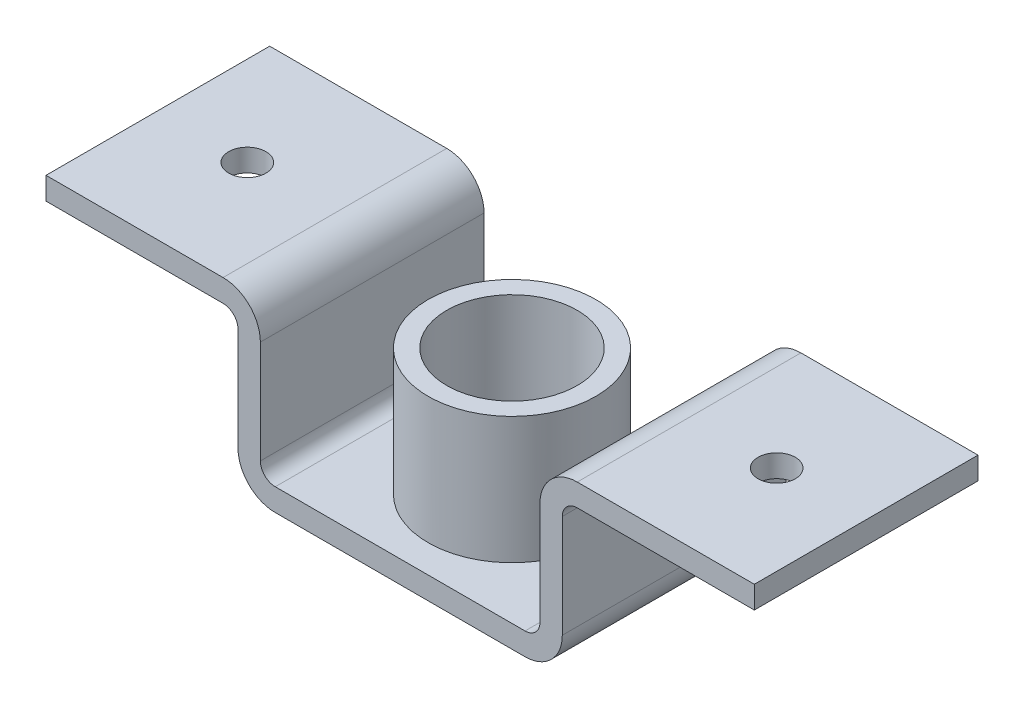
ISO-10303-21;
HEADER;
FILE_DESCRIPTION(('STEP AP214'),'2;1');
FILE_NAME('part.step','',(''),(''),'','','');
FILE_SCHEMA(('AUTOMOTIVE_DESIGN { 1 0 10303 214 1 1 1 1 }'));
ENDSEC;
DATA;
#1=APPLICATION_CONTEXT('core data for automotive mechanical design processes');
#2=APPLICATION_PROTOCOL_DEFINITION('international standard','automotive_design',2000,#1);
#3=PRODUCT_CONTEXT('',#1,'mechanical');
#4=PRODUCT('Part','Part','',(#3));
#5=PRODUCT_RELATED_PRODUCT_CATEGORY('part','',(#4));
#6=PRODUCT_DEFINITION_FORMATION('','',#4);
#7=PRODUCT_DEFINITION_CONTEXT('part definition',#1,'design');
#8=PRODUCT_DEFINITION('design','',#6,#7);
#9=PRODUCT_DEFINITION_SHAPE('','',#8);
#10=(LENGTH_UNIT() NAMED_UNIT(*) SI_UNIT(.MILLI.,.METRE.));
#11=(NAMED_UNIT(*) PLANE_ANGLE_UNIT() SI_UNIT($,.RADIAN.));
#12=(NAMED_UNIT(*) SI_UNIT($,.STERADIAN.) SOLID_ANGLE_UNIT());
#13=UNCERTAINTY_MEASURE_WITH_UNIT(LENGTH_MEASURE(1.E-05),#10,'distance_accuracy_value','');
#14=(GEOMETRIC_REPRESENTATION_CONTEXT(3) GLOBAL_UNCERTAINTY_ASSIGNED_CONTEXT((#13)) GLOBAL_UNIT_ASSIGNED_CONTEXT((#10,
#11,#12)) REPRESENTATION_CONTEXT('',''));
#15=CARTESIAN_POINT('',(0.,0.,0.));
#16=DIRECTION('',(0.,0.,1.));
#17=DIRECTION('',(1.,0.,0.));
#18=AXIS2_PLACEMENT_3D('',#15,#16,#17);
#19=CARTESIAN_POINT('',(237.494317450521,188.,300.));
#20=DIRECTION('',(0.,0.,-1.));
#21=DIRECTION('',(-1.,0.,0.));
#22=AXIS2_PLACEMENT_3D('',#19,#20,#21);
#23=CYLINDRICAL_SURFACE('',#22,20.);
#24=CARTESIAN_POINT('',(237.494317450521,188.,0.));
#25=DIRECTION('',(0.,0.,-1.));
#26=DIRECTION('',(-1.,0.,0.));
#27=AXIS2_PLACEMENT_3D('',#24,#25,#26);
#28=CIRCLE('',#27,20.);
#29=CARTESIAN_POINT('',(217.494318258035,188.005683356763,0.));
#30=VERTEX_POINT('',#29);
#31=CARTESIAN_POINT('',(237.494317450521,208.,0.));
#32=VERTEX_POINT('',#31);
#33=EDGE_CURVE('E201',#30,#32,#28,.T.);
#34=ORIENTED_EDGE('',*,*,#33,.T.);
#35=DIRECTION('',(0.,0.,-1.));
#36=VECTOR('',#35,1.);
#37=CARTESIAN_POINT('',(237.494317450521,208.,300.));
#38=LINE('',#37,#36);
#39=CARTESIAN_POINT('',(237.494317450521,208.,300.));
#40=VERTEX_POINT('',#39);
#41=EDGE_CURVE('E41',#40,#32,#38,.T.);
#42=ORIENTED_EDGE('',*,*,#41,.F.);
#43=CARTESIAN_POINT('',(237.494317450521,188.,300.));
#44=DIRECTION('',(0.,0.,-1.));
#45=DIRECTION('',(-1.,0.,0.));
#46=AXIS2_PLACEMENT_3D('',#43,#44,#45);
#47=CIRCLE('',#46,20.);
#48=CARTESIAN_POINT('',(217.494318258035,188.005683356763,300.));
#49=VERTEX_POINT('',#48);
#50=EDGE_CURVE('E242',#49,#40,#47,.T.);
#51=ORIENTED_EDGE('',*,*,#50,.F.);
#52=DIRECTION('',(0.,0.,-1.));
#53=VECTOR('',#52,1.);
#54=CARTESIAN_POINT('',(217.494318258035,188.005683356763,300.));
#55=LINE('',#54,#53);
#56=EDGE_CURVE('E197',#49,#30,#55,.T.);
#57=ORIENTED_EDGE('',*,*,#56,.T.);
#58=EDGE_LOOP('',(#34,#42,#51,#57));
#59=FACE_BOUND('',#58,.T.);
#60=ADVANCED_FACE('F33',(#59),#23,.F.);
#61=CARTESIAN_POINT('',(237.494317450521,208.,300.));
#62=DIRECTION('',(0.,1.,0.));
#63=DIRECTION('',(-1.,0.,0.));
#64=AXIS2_PLACEMENT_3D('',#61,#62,#63);
#65=PLANE('',#64);
#66=CARTESIAN_POINT('',(355.,208.,150.));
#67=DIRECTION('',(0.,1.,0.));
#68=DIRECTION('',(-1.,0.,0.));
#69=AXIS2_PLACEMENT_3D('',#66,#67,#68);
#70=CIRCLE('',#69,25.);
#71=CARTESIAN_POINT('',(330.,208.,150.));
#72=VERTEX_POINT('',#71);
#73=EDGE_CURVE('E205',#72,#72,#70,.T.);
#74=ORIENTED_EDGE('',*,*,#73,.T.);
#75=EDGE_LOOP('',(#74));
#76=FACE_BOUND('',#75,.T.);
#77=DIRECTION('',(1.,0.,0.));
#78=VECTOR('',#77,1.);
#79=CARTESIAN_POINT('',(237.494317450521,208.,0.));
#80=LINE('',#79,#78);
#81=CARTESIAN_POINT('',(475.,208.,0.));
#82=VERTEX_POINT('',#81);
#83=EDGE_CURVE('E204',#32,#82,#80,.T.);
#84=ORIENTED_EDGE('',*,*,#83,.T.);
#85=DIRECTION('',(0.,0.,-1.));
#86=VECTOR('',#85,1.);
#87=CARTESIAN_POINT('',(475.,208.,300.));
#88=LINE('',#87,#86);
#89=CARTESIAN_POINT('',(475.,208.,300.));
#90=VERTEX_POINT('',#89);
#91=EDGE_CURVE('E288',#90,#82,#88,.T.);
#92=ORIENTED_EDGE('',*,*,#91,.F.);
#93=DIRECTION('',(1.,0.,0.));
#94=VECTOR('',#93,1.);
#95=CARTESIAN_POINT('',(237.494317450521,208.,300.));
#96=LINE('',#95,#94);
#97=EDGE_CURVE('E129',#40,#90,#96,.T.);
#98=ORIENTED_EDGE('',*,*,#97,.F.);
#99=ORIENTED_EDGE('',*,*,#41,.T.);
#100=EDGE_LOOP('',(#84,#92,#98,#99));
#101=FACE_BOUND('',#100,.T.);
#102=ADVANCED_FACE('F369',(#76,#101),#65,.F.);
#103=CARTESIAN_POINT('',(475.,208.,300.));
#104=DIRECTION('',(-1.,0.,0.));
#105=DIRECTION('',(0.,0.,1.));
#106=AXIS2_PLACEMENT_3D('',#103,#104,#105);
#107=PLANE('',#106);
#108=DIRECTION('',(0.,1.,0.));
#109=VECTOR('',#108,1.);
#110=CARTESIAN_POINT('',(475.,208.,0.));
#111=LINE('',#110,#109);
#112=CARTESIAN_POINT('',(475.,238.,0.));
#113=VERTEX_POINT('',#112);
#114=EDGE_CURVE('E207',#82,#113,#111,.T.);
#115=ORIENTED_EDGE('',*,*,#114,.T.);
#116=DIRECTION('',(0.,0.,-1.));
#117=VECTOR('',#116,1.);
#118=CARTESIAN_POINT('',(475.,238.,300.));
#119=LINE('',#118,#117);
#120=CARTESIAN_POINT('',(475.,238.,300.));
#121=VERTEX_POINT('',#120);
#122=EDGE_CURVE('E285',#121,#113,#119,.T.);
#123=ORIENTED_EDGE('',*,*,#122,.F.);
#124=DIRECTION('',(0.,1.,0.));
#125=VECTOR('',#124,1.);
#126=CARTESIAN_POINT('',(475.,208.,300.));
#127=LINE('',#126,#125);
#128=EDGE_CURVE('E313',#90,#121,#127,.T.);
#129=ORIENTED_EDGE('',*,*,#128,.F.);
#130=ORIENTED_EDGE('',*,*,#91,.T.);
#131=EDGE_LOOP('',(#115,#123,#129,#130));
#132=FACE_BOUND('',#131,.T.);
#133=ADVANCED_FACE('F373',(#132),#107,.F.);
#134=CARTESIAN_POINT('',(237.5,238.,300.));
#135=DIRECTION('',(0.,-1.,0.));
#136=DIRECTION('',(1.,0.,0.));
#137=AXIS2_PLACEMENT_3D('',#134,#135,#136);
#138=PLANE('',#137);
#139=CARTESIAN_POINT('',(355.,238.,150.));
#140=DIRECTION('',(0.,1.,0.));
#141=DIRECTION('',(-1.,0.,0.));
#142=AXIS2_PLACEMENT_3D('',#139,#140,#141);
#143=CIRCLE('',#142,25.);
#144=CARTESIAN_POINT('',(330.,238.,150.));
#145=VERTEX_POINT('',#144);
#146=EDGE_CURVE('E293',#145,#145,#143,.T.);
#147=ORIENTED_EDGE('',*,*,#146,.F.);
#148=EDGE_LOOP('',(#147));
#149=FACE_BOUND('',#148,.T.);
#150=DIRECTION('',(-1.,0.,0.));
#151=VECTOR('',#150,1.);
#152=CARTESIAN_POINT('',(237.5,238.,0.));
#153=LINE('',#152,#151);
#154=CARTESIAN_POINT('',(237.5,238.,0.));
#155=VERTEX_POINT('',#154);
#156=EDGE_CURVE('E209',#113,#155,#153,.T.);
#157=ORIENTED_EDGE('',*,*,#156,.T.);
#158=DIRECTION('',(0.,0.,-1.));
#159=VECTOR('',#158,1.);
#160=CARTESIAN_POINT('',(237.5,238.,300.));
#161=LINE('',#160,#159);
#162=CARTESIAN_POINT('',(237.5,238.,300.));
#163=VERTEX_POINT('',#162);
#164=EDGE_CURVE('E282',#163,#155,#161,.T.);
#165=ORIENTED_EDGE('',*,*,#164,.F.);
#166=DIRECTION('',(-1.,0.,0.));
#167=VECTOR('',#166,1.);
#168=CARTESIAN_POINT('',(237.5,238.,300.));
#169=LINE('',#168,#167);
#170=EDGE_CURVE('E315',#121,#163,#169,.T.);
#171=ORIENTED_EDGE('',*,*,#170,.F.);
#172=ORIENTED_EDGE('',*,*,#122,.T.);
#173=EDGE_LOOP('',(#157,#165,#171,#172));
#174=FACE_BOUND('',#173,.T.);
#175=ADVANCED_FACE('F378',(#149,#174),#138,.F.);
#176=CARTESIAN_POINT('',(237.5,188.,300.));
#177=DIRECTION('',(0.,0.,-1.));
#178=DIRECTION('',(-1.,0.,0.));
#179=AXIS2_PLACEMENT_3D('',#176,#177,#178);
#180=CYLINDRICAL_SURFACE('',#179,50.);
#181=CARTESIAN_POINT('',(237.5,188.,0.));
#182=DIRECTION('',(0.,0.,1.));
#183=DIRECTION('',(-1.,0.,0.));
#184=AXIS2_PLACEMENT_3D('',#181,#182,#183);
#185=CIRCLE('',#184,50.);
#186=CARTESIAN_POINT('',(187.5,188.,0.));
#187=VERTEX_POINT('',#186);
#188=EDGE_CURVE('E211',#155,#187,#185,.T.);
#189=ORIENTED_EDGE('',*,*,#188,.T.);
#190=DIRECTION('',(0.,0.,-1.));
#191=VECTOR('',#190,1.);
#192=CARTESIAN_POINT('',(187.5,188.,300.));
#193=LINE('',#192,#191);
#194=CARTESIAN_POINT('',(187.5,188.,300.));
#195=VERTEX_POINT('',#194);
#196=EDGE_CURVE('E279',#195,#187,#193,.T.);
#197=ORIENTED_EDGE('',*,*,#196,.F.);
#198=CARTESIAN_POINT('',(237.5,188.,300.));
#199=DIRECTION('',(0.,0.,1.));
#200=DIRECTION('',(-1.,0.,0.));
#201=AXIS2_PLACEMENT_3D('',#198,#199,#200);
#202=CIRCLE('',#201,50.);
#203=EDGE_CURVE('E317',#163,#195,#202,.T.);
#204=ORIENTED_EDGE('',*,*,#203,.F.);
#205=ORIENTED_EDGE('',*,*,#164,.T.);
#206=EDGE_LOOP('',(#189,#197,#204,#205));
#207=FACE_BOUND('',#206,.T.);
#208=ADVANCED_FACE('F384',(#207),#180,.T.);
#209=CARTESIAN_POINT('',(187.5,50.,300.));
#210=DIRECTION('',(1.,0.,0.));
#211=DIRECTION('',(0.,0.,-1.));
#212=AXIS2_PLACEMENT_3D('',#209,#210,#211);
#213=PLANE('',#212);
#214=DIRECTION('',(0.,-1.,0.));
#215=VECTOR('',#214,1.);
#216=CARTESIAN_POINT('',(187.5,50.,0.));
#217=LINE('',#216,#215);
#218=CARTESIAN_POINT('',(187.5,50.,0.));
#219=VERTEX_POINT('',#218);
#220=EDGE_CURVE('E213',#187,#219,#217,.T.);
#221=ORIENTED_EDGE('',*,*,#220,.T.);
#222=DIRECTION('',(0.,0.,-1.));
#223=VECTOR('',#222,1.);
#224=CARTESIAN_POINT('',(187.5,50.,300.));
#225=LINE('',#224,#223);
#226=CARTESIAN_POINT('',(187.5,50.,300.));
#227=VERTEX_POINT('',#226);
#228=EDGE_CURVE('E276',#227,#219,#225,.T.);
#229=ORIENTED_EDGE('',*,*,#228,.F.);
#230=DIRECTION('',(0.,-1.,0.));
#231=VECTOR('',#230,1.);
#232=CARTESIAN_POINT('',(187.5,50.,300.));
#233=LINE('',#232,#231);
#234=EDGE_CURVE('E319',#195,#227,#233,.T.);
#235=ORIENTED_EDGE('',*,*,#234,.F.);
#236=ORIENTED_EDGE('',*,*,#196,.T.);
#237=EDGE_LOOP('',(#221,#229,#235,#236));
#238=FACE_BOUND('',#237,.T.);
#239=ADVANCED_FACE('F388',(#238),#213,.F.);
#240=CARTESIAN_POINT('',(167.5,50.,300.));
#241=DIRECTION('',(0.,0.,-1.));
#242=DIRECTION('',(-1.,0.,0.));
#243=AXIS2_PLACEMENT_3D('',#240,#241,#242);
#244=CYLINDRICAL_SURFACE('',#243,20.);
#245=CARTESIAN_POINT('',(167.5,50.,0.));
#246=DIRECTION('',(0.,0.,-1.));
#247=DIRECTION('',(1.,0.,0.));
#248=AXIS2_PLACEMENT_3D('',#245,#246,#247);
#249=CIRCLE('',#248,20.);
#250=CARTESIAN_POINT('',(167.5,30.,0.));
#251=VERTEX_POINT('',#250);
#252=EDGE_CURVE('E215',#219,#251,#249,.T.);
#253=ORIENTED_EDGE('',*,*,#252,.T.);
#254=DIRECTION('',(0.,0.,-1.));
#255=VECTOR('',#254,1.);
#256=CARTESIAN_POINT('',(167.5,30.,300.));
#257=LINE('',#256,#255);
#258=CARTESIAN_POINT('',(167.5,30.,300.));
#259=VERTEX_POINT('',#258);
#260=EDGE_CURVE('E273',#259,#251,#257,.T.);
#261=ORIENTED_EDGE('',*,*,#260,.F.);
#262=CARTESIAN_POINT('',(167.5,50.,300.));
#263=DIRECTION('',(0.,0.,-1.));
#264=DIRECTION('',(1.,0.,0.));
#265=AXIS2_PLACEMENT_3D('',#262,#263,#264);
#266=CIRCLE('',#265,20.);
#267=EDGE_CURVE('E321',#227,#259,#266,.T.);
#268=ORIENTED_EDGE('',*,*,#267,.F.);
#269=ORIENTED_EDGE('',*,*,#228,.T.);
#270=EDGE_LOOP('',(#253,#261,#268,#269));
#271=FACE_BOUND('',#270,.T.);
#272=ADVANCED_FACE('F392',(#271),#244,.F.);
#273=CARTESIAN_POINT('',(0.,30.,300.));
#274=DIRECTION('',(0.,-1.,0.));
#275=DIRECTION('',(1.,0.,0.));
#276=AXIS2_PLACEMENT_3D('',#273,#274,#275);
#277=PLANE('',#276);
#278=CARTESIAN_POINT('',(0.,30.,150.));
#279=DIRECTION('',(0.,-1.,0.));
#280=DIRECTION('',(1.,0.,0.));
#281=AXIS2_PLACEMENT_3D('',#278,#279,#280);
#282=CIRCLE('',#281,112.5);
#283=CARTESIAN_POINT('',(112.5,30.,150.));
#284=VERTEX_POINT('',#283);
#285=EDGE_CURVE('E11',#284,#284,#282,.F.);
#286=ORIENTED_EDGE('',*,*,#285,.F.);
#287=EDGE_LOOP('',(#286));
#288=FACE_BOUND('',#287,.T.);
#289=DIRECTION('',(-1.,0.,0.));
#290=VECTOR('',#289,1.);
#291=CARTESIAN_POINT('',(0.,30.,0.));
#292=LINE('',#291,#290);
#293=CARTESIAN_POINT('',(-167.5,30.,0.));
#294=VERTEX_POINT('',#293);
#295=EDGE_CURVE('E218',#251,#294,#292,.T.);
#296=ORIENTED_EDGE('',*,*,#295,.T.);
#297=DIRECTION('',(0.,0.,-1.));
#298=VECTOR('',#297,1.);
#299=CARTESIAN_POINT('',(-167.5,30.,300.));
#300=LINE('',#299,#298);
#301=CARTESIAN_POINT('',(-167.5,30.,300.));
#302=VERTEX_POINT('',#301);
#303=EDGE_CURVE('E270',#302,#294,#300,.T.);
#304=ORIENTED_EDGE('',*,*,#303,.F.);
#305=DIRECTION('',(-1.,0.,0.));
#306=VECTOR('',#305,1.);
#307=CARTESIAN_POINT('',(0.,30.,300.));
#308=LINE('',#307,#306);
#309=EDGE_CURVE('E323',#259,#302,#308,.T.);
#310=ORIENTED_EDGE('',*,*,#309,.F.);
#311=ORIENTED_EDGE('',*,*,#260,.T.);
#312=EDGE_LOOP('',(#296,#304,#310,#311));
#313=FACE_BOUND('',#312,.T.);
#314=ADVANCED_FACE('F396',(#288,#313),#277,.F.);
#315=CARTESIAN_POINT('',(-167.5,50.,300.));
#316=DIRECTION('',(0.,0.,-1.));
#317=DIRECTION('',(-1.,0.,0.));
#318=AXIS2_PLACEMENT_3D('',#315,#316,#317);
#319=CYLINDRICAL_SURFACE('',#318,20.);
#320=CARTESIAN_POINT('',(-167.5,50.,0.));
#321=DIRECTION('',(0.,0.,-1.));
#322=DIRECTION('',(-1.,0.,0.));
#323=AXIS2_PLACEMENT_3D('',#320,#321,#322);
#324=CIRCLE('',#323,20.);
#325=CARTESIAN_POINT('',(-187.5,50.,0.));
#326=VERTEX_POINT('',#325);
#327=EDGE_CURVE('E220',#294,#326,#324,.T.);
#328=ORIENTED_EDGE('',*,*,#327,.T.);
#329=DIRECTION('',(0.,0.,-1.));
#330=VECTOR('',#329,1.);
#331=CARTESIAN_POINT('',(-187.5,50.,300.));
#332=LINE('',#331,#330);
#333=CARTESIAN_POINT('',(-187.5,50.,300.));
#334=VERTEX_POINT('',#333);
#335=EDGE_CURVE('E267',#334,#326,#332,.T.);
#336=ORIENTED_EDGE('',*,*,#335,.F.);
#337=CARTESIAN_POINT('',(-167.5,50.,300.));
#338=DIRECTION('',(0.,0.,-1.));
#339=DIRECTION('',(-1.,0.,0.));
#340=AXIS2_PLACEMENT_3D('',#337,#338,#339);
#341=CIRCLE('',#340,20.);
#342=EDGE_CURVE('E325',#302,#334,#341,.T.);
#343=ORIENTED_EDGE('',*,*,#342,.F.);
#344=ORIENTED_EDGE('',*,*,#303,.T.);
#345=EDGE_LOOP('',(#328,#336,#343,#344));
#346=FACE_BOUND('',#345,.T.);
#347=ADVANCED_FACE('F400',(#346),#319,.F.);
#348=CARTESIAN_POINT('',(-187.5,50.,300.));
#349=DIRECTION('',(-1.,0.,0.));
#350=DIRECTION('',(0.,0.,1.));
#351=AXIS2_PLACEMENT_3D('',#348,#349,#350);
#352=PLANE('',#351);
#353=DIRECTION('',(0.,1.,0.));
#354=VECTOR('',#353,1.);
#355=CARTESIAN_POINT('',(-187.5,50.,0.));
#356=LINE('',#355,#354);
#357=CARTESIAN_POINT('',(-187.5,188.,0.));
#358=VERTEX_POINT('',#357);
#359=EDGE_CURVE('E222',#326,#358,#356,.T.);
#360=ORIENTED_EDGE('',*,*,#359,.T.);
#361=DIRECTION('',(0.,0.,-1.));
#362=VECTOR('',#361,1.);
#363=CARTESIAN_POINT('',(-187.5,188.,300.));
#364=LINE('',#363,#362);
#365=CARTESIAN_POINT('',(-187.5,188.,300.));
#366=VERTEX_POINT('',#365);
#367=EDGE_CURVE('E264',#366,#358,#364,.T.);
#368=ORIENTED_EDGE('',*,*,#367,.F.);
#369=DIRECTION('',(0.,1.,0.));
#370=VECTOR('',#369,1.);
#371=CARTESIAN_POINT('',(-187.5,50.,300.));
#372=LINE('',#371,#370);
#373=EDGE_CURVE('E327',#334,#366,#372,.T.);
#374=ORIENTED_EDGE('',*,*,#373,.F.);
#375=ORIENTED_EDGE('',*,*,#335,.T.);
#376=EDGE_LOOP('',(#360,#368,#374,#375));
#377=FACE_BOUND('',#376,.T.);
#378=ADVANCED_FACE('F405',(#377),#352,.F.);
#379=CARTESIAN_POINT('',(-237.5,188.,300.));
#380=DIRECTION('',(0.,0.,-1.));
#381=DIRECTION('',(-1.,0.,0.));
#382=AXIS2_PLACEMENT_3D('',#379,#380,#381);
#383=CYLINDRICAL_SURFACE('',#382,50.);
#384=CARTESIAN_POINT('',(-237.5,188.,0.));
#385=DIRECTION('',(0.,0.,1.));
#386=DIRECTION('',(1.,0.,0.));
#387=AXIS2_PLACEMENT_3D('',#384,#385,#386);
#388=CIRCLE('',#387,50.);
#389=CARTESIAN_POINT('',(-237.5,238.,0.));
#390=VERTEX_POINT('',#389);
#391=EDGE_CURVE('E224',#358,#390,#388,.T.);
#392=ORIENTED_EDGE('',*,*,#391,.T.);
#393=DIRECTION('',(0.,0.,-1.));
#394=VECTOR('',#393,1.);
#395=CARTESIAN_POINT('',(-237.5,238.,300.));
#396=LINE('',#395,#394);
#397=CARTESIAN_POINT('',(-237.5,238.,300.));
#398=VERTEX_POINT('',#397);
#399=EDGE_CURVE('E261',#398,#390,#396,.T.);
#400=ORIENTED_EDGE('',*,*,#399,.F.);
#401=CARTESIAN_POINT('',(-237.5,188.,300.));
#402=DIRECTION('',(0.,0.,1.));
#403=DIRECTION('',(1.,0.,0.));
#404=AXIS2_PLACEMENT_3D('',#401,#402,#403);
#405=CIRCLE('',#404,50.);
#406=EDGE_CURVE('E329',#366,#398,#405,.T.);
#407=ORIENTED_EDGE('',*,*,#406,.F.);
#408=ORIENTED_EDGE('',*,*,#367,.T.);
#409=EDGE_LOOP('',(#392,#400,#407,#408));
#410=FACE_BOUND('',#409,.T.);
#411=ADVANCED_FACE('F409',(#410),#383,.T.);
#412=CARTESIAN_POINT('',(-237.5,238.,300.));
#413=DIRECTION('',(0.,-1.,0.));
#414=DIRECTION('',(1.,0.,0.));
#415=AXIS2_PLACEMENT_3D('',#412,#413,#414);
#416=PLANE('',#415);
#417=CARTESIAN_POINT('',(-355.,238.,150.));
#418=DIRECTION('',(0.,1.,0.));
#419=DIRECTION('',(-1.,0.,0.));
#420=AXIS2_PLACEMENT_3D('',#417,#418,#419);
#421=CIRCLE('',#420,25.);
#422=CARTESIAN_POINT('',(-380.,238.,150.));
#423=VERTEX_POINT('',#422);
#424=EDGE_CURVE('E294',#423,#423,#421,.T.);
#425=ORIENTED_EDGE('',*,*,#424,.F.);
#426=EDGE_LOOP('',(#425));
#427=FACE_BOUND('',#426,.T.);
#428=DIRECTION('',(-1.,0.,0.));
#429=VECTOR('',#428,1.);
#430=CARTESIAN_POINT('',(-237.5,238.,0.));
#431=LINE('',#430,#429);
#432=CARTESIAN_POINT('',(-475.,238.,0.));
#433=VERTEX_POINT('',#432);
#434=EDGE_CURVE('E226',#390,#433,#431,.T.);
#435=ORIENTED_EDGE('',*,*,#434,.T.);
#436=DIRECTION('',(0.,0.,-1.));
#437=VECTOR('',#436,1.);
#438=CARTESIAN_POINT('',(-475.,238.,300.));
#439=LINE('',#438,#437);
#440=CARTESIAN_POINT('',(-475.,238.,300.));
#441=VERTEX_POINT('',#440);
#442=EDGE_CURVE('E258',#441,#433,#439,.T.);
#443=ORIENTED_EDGE('',*,*,#442,.F.);
#444=DIRECTION('',(-1.,0.,0.));
#445=VECTOR('',#444,1.);
#446=CARTESIAN_POINT('',(-237.5,238.,300.));
#447=LINE('',#446,#445);
#448=EDGE_CURVE('E331',#398,#441,#447,.T.);
#449=ORIENTED_EDGE('',*,*,#448,.F.);
#450=ORIENTED_EDGE('',*,*,#399,.T.);
#451=EDGE_LOOP('',(#435,#443,#449,#450));
#452=FACE_BOUND('',#451,.T.);
#453=ADVANCED_FACE('F413',(#427,#452),#416,.F.);
#454=CARTESIAN_POINT('',(-475.,208.,300.));
#455=DIRECTION('',(1.,0.,0.));
#456=DIRECTION('',(0.,0.,-1.));
#457=AXIS2_PLACEMENT_3D('',#454,#455,#456);
#458=PLANE('',#457);
#459=DIRECTION('',(0.,-1.,0.));
#460=VECTOR('',#459,1.);
#461=CARTESIAN_POINT('',(-475.,208.,0.));
#462=LINE('',#461,#460);
#463=CARTESIAN_POINT('',(-475.,208.,0.));
#464=VERTEX_POINT('',#463);
#465=EDGE_CURVE('E228',#433,#464,#462,.T.);
#466=ORIENTED_EDGE('',*,*,#465,.T.);
#467=DIRECTION('',(0.,0.,-1.));
#468=VECTOR('',#467,1.);
#469=CARTESIAN_POINT('',(-475.,208.,300.));
#470=LINE('',#469,#468);
#471=CARTESIAN_POINT('',(-475.,208.,300.));
#472=VERTEX_POINT('',#471);
#473=EDGE_CURVE('E255',#472,#464,#470,.T.);
#474=ORIENTED_EDGE('',*,*,#473,.F.);
#475=DIRECTION('',(0.,-1.,0.));
#476=VECTOR('',#475,1.);
#477=CARTESIAN_POINT('',(-475.,208.,300.));
#478=LINE('',#477,#476);
#479=EDGE_CURVE('E333',#441,#472,#478,.T.);
#480=ORIENTED_EDGE('',*,*,#479,.F.);
#481=ORIENTED_EDGE('',*,*,#442,.T.);
#482=EDGE_LOOP('',(#466,#474,#480,#481));
#483=FACE_BOUND('',#482,.T.);
#484=ADVANCED_FACE('F417',(#483),#458,.F.);
#485=CARTESIAN_POINT('',(-237.5,208.,300.));
#486=DIRECTION('',(0.,1.,0.));
#487=DIRECTION('',(-1.,0.,0.));
#488=AXIS2_PLACEMENT_3D('',#485,#486,#487);
#489=PLANE('',#488);
#490=CARTESIAN_POINT('',(-355.,208.,150.));
#491=DIRECTION('',(0.,1.,0.));
#492=DIRECTION('',(-1.,0.,0.));
#493=AXIS2_PLACEMENT_3D('',#490,#491,#492);
#494=CIRCLE('',#493,25.);
#495=CARTESIAN_POINT('',(-380.,208.,150.));
#496=VERTEX_POINT('',#495);
#497=EDGE_CURVE('E291',#496,#496,#494,.T.);
#498=ORIENTED_EDGE('',*,*,#497,.T.);
#499=EDGE_LOOP('',(#498));
#500=FACE_BOUND('',#499,.T.);
#501=DIRECTION('',(1.,0.,0.));
#502=VECTOR('',#501,1.);
#503=CARTESIAN_POINT('',(-237.5,208.,0.));
#504=LINE('',#503,#502);
#505=CARTESIAN_POINT('',(-237.5,208.,0.));
#506=VERTEX_POINT('',#505);
#507=EDGE_CURVE('E230',#464,#506,#504,.T.);
#508=ORIENTED_EDGE('',*,*,#507,.T.);
#509=DIRECTION('',(0.,0.,-1.));
#510=VECTOR('',#509,1.);
#511=CARTESIAN_POINT('',(-237.5,208.,300.));
#512=LINE('',#511,#510);
#513=CARTESIAN_POINT('',(-237.5,208.,300.));
#514=VERTEX_POINT('',#513);
#515=EDGE_CURVE('E252',#514,#506,#512,.T.);
#516=ORIENTED_EDGE('',*,*,#515,.F.);
#517=DIRECTION('',(1.,0.,0.));
#518=VECTOR('',#517,1.);
#519=CARTESIAN_POINT('',(-237.5,208.,300.));
#520=LINE('',#519,#518);
#521=EDGE_CURVE('E335',#472,#514,#520,.T.);
#522=ORIENTED_EDGE('',*,*,#521,.F.);
#523=ORIENTED_EDGE('',*,*,#473,.T.);
#524=EDGE_LOOP('',(#508,#516,#522,#523));
#525=FACE_BOUND('',#524,.T.);
#526=ADVANCED_FACE('F421',(#500,#525),#489,.F.);
#527=CARTESIAN_POINT('',(-237.5,188.,300.));
#528=DIRECTION('',(0.,0.,-1.));
#529=DIRECTION('',(-1.,0.,0.));
#530=AXIS2_PLACEMENT_3D('',#527,#528,#529);
#531=CYLINDRICAL_SURFACE('',#530,20.);
#532=CARTESIAN_POINT('',(-237.5,188.,0.));
#533=DIRECTION('',(0.,0.,-1.));
#534=DIRECTION('',(1.,0.,0.));
#535=AXIS2_PLACEMENT_3D('',#532,#533,#534);
#536=CIRCLE('',#535,20.);
#537=CARTESIAN_POINT('',(-217.5,188.,0.));
#538=VERTEX_POINT('',#537);
#539=EDGE_CURVE('E232',#506,#538,#536,.T.);
#540=ORIENTED_EDGE('',*,*,#539,.T.);
#541=DIRECTION('',(0.,0.,-1.));
#542=VECTOR('',#541,1.);
#543=CARTESIAN_POINT('',(-217.5,188.,300.));
#544=LINE('',#543,#542);
#545=CARTESIAN_POINT('',(-217.5,188.,300.));
#546=VERTEX_POINT('',#545);
#547=EDGE_CURVE('E249',#546,#538,#544,.T.);
#548=ORIENTED_EDGE('',*,*,#547,.F.);
#549=CARTESIAN_POINT('',(-237.5,188.,300.));
#550=DIRECTION('',(0.,0.,-1.));
#551=DIRECTION('',(1.,0.,0.));
#552=AXIS2_PLACEMENT_3D('',#549,#550,#551);
#553=CIRCLE('',#552,20.);
#554=EDGE_CURVE('E337',#514,#546,#553,.T.);
#555=ORIENTED_EDGE('',*,*,#554,.F.);
#556=ORIENTED_EDGE('',*,*,#515,.T.);
#557=EDGE_LOOP('',(#540,#548,#555,#556));
#558=FACE_BOUND('',#557,.T.);
#559=ADVANCED_FACE('F425',(#558),#531,.F.);
#560=CARTESIAN_POINT('',(-217.5,50.,300.));
#561=DIRECTION('',(1.,0.,0.));
#562=DIRECTION('',(0.,1.,0.));
#563=AXIS2_PLACEMENT_3D('',#560,#561,#562);
#564=PLANE('',#563);
#565=DIRECTION('',(0.,-1.,0.));
#566=VECTOR('',#565,1.);
#567=CARTESIAN_POINT('',(-217.5,50.,0.));
#568=LINE('',#567,#566);
#569=CARTESIAN_POINT('',(-217.5,50.,0.));
#570=VERTEX_POINT('',#569);
#571=EDGE_CURVE('E234',#538,#570,#568,.T.);
#572=ORIENTED_EDGE('',*,*,#571,.T.);
#573=DIRECTION('',(0.,0.,-1.));
#574=VECTOR('',#573,1.);
#575=CARTESIAN_POINT('',(-217.5,50.,300.));
#576=LINE('',#575,#574);
#577=CARTESIAN_POINT('',(-217.5,50.,300.));
#578=VERTEX_POINT('',#577);
#579=EDGE_CURVE('E246',#578,#570,#576,.T.);
#580=ORIENTED_EDGE('',*,*,#579,.F.);
#581=DIRECTION('',(0.,-1.,0.));
#582=VECTOR('',#581,1.);
#583=CARTESIAN_POINT('',(-217.5,50.,300.));
#584=LINE('',#583,#582);
#585=EDGE_CURVE('E339',#546,#578,#584,.T.);
#586=ORIENTED_EDGE('',*,*,#585,.F.);
#587=ORIENTED_EDGE('',*,*,#547,.T.);
#588=EDGE_LOOP('',(#572,#580,#586,#587));
#589=FACE_BOUND('',#588,.T.);
#590=ADVANCED_FACE('F345',(#589),#564,.F.);
#591=CARTESIAN_POINT('',(-167.5,50.,300.));
#592=DIRECTION('',(0.,0.,-1.));
#593=DIRECTION('',(-1.,0.,0.));
#594=AXIS2_PLACEMENT_3D('',#591,#592,#593);
#595=CYLINDRICAL_SURFACE('',#594,50.);
#596=CARTESIAN_POINT('',(-167.5,50.,0.));
#597=DIRECTION('',(0.,0.,1.));
#598=DIRECTION('',(-1.,0.,0.));
#599=AXIS2_PLACEMENT_3D('',#596,#597,#598);
#600=CIRCLE('',#599,50.);
#601=CARTESIAN_POINT('',(-167.5,0.,0.));
#602=VERTEX_POINT('',#601);
#603=EDGE_CURVE('E236',#570,#602,#600,.T.);
#604=ORIENTED_EDGE('',*,*,#603,.T.);
#605=DIRECTION('',(0.,0.,-1.));
#606=VECTOR('',#605,1.);
#607=CARTESIAN_POINT('',(-167.5,0.,300.));
#608=LINE('',#607,#606);
#609=CARTESIAN_POINT('',(-167.5,0.,300.));
#610=VERTEX_POINT('',#609);
#611=EDGE_CURVE('E192',#610,#602,#608,.T.);
#612=ORIENTED_EDGE('',*,*,#611,.F.);
#613=CARTESIAN_POINT('',(-167.5,50.,300.));
#614=DIRECTION('',(0.,0.,1.));
#615=DIRECTION('',(-1.,0.,0.));
#616=AXIS2_PLACEMENT_3D('',#613,#614,#615);
#617=CIRCLE('',#616,50.);
#618=EDGE_CURVE('E184',#578,#610,#617,.T.);
#619=ORIENTED_EDGE('',*,*,#618,.F.);
#620=ORIENTED_EDGE('',*,*,#579,.T.);
#621=EDGE_LOOP('',(#604,#612,#619,#620));
#622=FACE_BOUND('',#621,.T.);
#623=ADVANCED_FACE('F349',(#622),#595,.T.);
#624=CARTESIAN_POINT('',(0.,0.,300.));
#625=DIRECTION('',(0.,1.,0.));
#626=DIRECTION('',(0.,0.,1.));
#627=AXIS2_PLACEMENT_3D('',#624,#625,#626);
#628=PLANE('',#627);
#629=CARTESIAN_POINT('',(0.,0.,150.));
#630=DIRECTION('',(0.,1.,0.));
#631=DIRECTION('',(0.,0.,1.));
#632=AXIS2_PLACEMENT_3D('',#629,#630,#631);
#633=CIRCLE('',#632,37.5);
#634=CARTESIAN_POINT('',(0.,0.,187.5));
#635=VERTEX_POINT('',#634);
#636=EDGE_CURVE('E439',#635,#635,#633,.T.);
#637=ORIENTED_EDGE('',*,*,#636,.T.);
#638=EDGE_LOOP('',(#637));
#639=FACE_BOUND('',#638,.T.);
#640=DIRECTION('',(1.,0.,0.));
#641=VECTOR('',#640,1.);
#642=CARTESIAN_POINT('',(0.,0.,0.));
#643=LINE('',#642,#641);
#644=CARTESIAN_POINT('',(167.455099460976,0.,0.));
#645=VERTEX_POINT('',#644);
#646=EDGE_CURVE('E191',#602,#645,#643,.T.);
#647=ORIENTED_EDGE('',*,*,#646,.T.);
#648=DIRECTION('',(0.,0.,-1.));
#649=VECTOR('',#648,1.);
#650=CARTESIAN_POINT('',(167.455099460976,0.,300.));
#651=LINE('',#650,#649);
#652=CARTESIAN_POINT('',(167.455099460976,0.,300.));
#653=VERTEX_POINT('',#652);
#654=EDGE_CURVE('E189',#653,#645,#651,.T.);
#655=ORIENTED_EDGE('',*,*,#654,.F.);
#656=DIRECTION('',(1.,0.,0.));
#657=VECTOR('',#656,1.);
#658=CARTESIAN_POINT('',(0.,0.,300.));
#659=LINE('',#658,#657);
#660=EDGE_CURVE('E178',#610,#653,#659,.T.);
#661=ORIENTED_EDGE('',*,*,#660,.F.);
#662=ORIENTED_EDGE('',*,*,#611,.T.);
#663=EDGE_LOOP('',(#647,#655,#661,#662));
#664=FACE_BOUND('',#663,.T.);
#665=ADVANCED_FACE('F190',(#639,#664),#628,.F.);
#666=CARTESIAN_POINT('',(167.455099460976,50.,300.));
#667=DIRECTION('',(0.,0.,-1.));
#668=DIRECTION('',(-1.,0.,0.));
#669=AXIS2_PLACEMENT_3D('',#666,#667,#668);
#670=CYLINDRICAL_SURFACE('',#669,50.);
#671=CARTESIAN_POINT('',(167.455099460976,50.,0.));
#672=DIRECTION('',(0.,0.,1.));
#673=DIRECTION('',(1.,0.,0.));
#674=AXIS2_PLACEMENT_3D('',#671,#672,#673);
#675=CIRCLE('',#674,50.);
#676=CARTESIAN_POINT('',(217.455097442192,49.9857916080927,0.));
#677=VERTEX_POINT('',#676);
#678=EDGE_CURVE('E114',#645,#677,#675,.T.);
#679=ORIENTED_EDGE('',*,*,#678,.T.);
#680=DIRECTION('',(0.,0.,-1.));
#681=VECTOR('',#680,1.);
#682=CARTESIAN_POINT('',(217.455097442192,49.9857916080927,300.));
#683=LINE('',#682,#681);
#684=CARTESIAN_POINT('',(217.455097442192,49.9857916080927,300.));
#685=VERTEX_POINT('',#684);
#686=EDGE_CURVE('E193',#685,#677,#683,.T.);
#687=ORIENTED_EDGE('',*,*,#686,.F.);
#688=CARTESIAN_POINT('',(167.455099460976,50.,300.));
#689=DIRECTION('',(0.,0.,1.));
#690=DIRECTION('',(1.,0.,0.));
#691=AXIS2_PLACEMENT_3D('',#688,#689,#690);
#692=CIRCLE('',#691,50.);
#693=EDGE_CURVE('E182',#653,#685,#692,.T.);
#694=ORIENTED_EDGE('',*,*,#693,.F.);
#695=ORIENTED_EDGE('',*,*,#654,.T.);
#696=EDGE_LOOP('',(#679,#687,#694,#695));
#697=FACE_BOUND('',#696,.T.);
#698=ADVANCED_FACE('F195',(#697),#670,.T.);
#699=CARTESIAN_POINT('',(217.455097442192,49.9857916080927,300.));
#700=DIRECTION('',(-0.999999959624319,0.000284167838146975,0.));
#701=DIRECTION('',(-0.000284167838146975,-0.999999959624319,0.));
#702=AXIS2_PLACEMENT_3D('',#699,#700,#701);
#703=PLANE('',#702);
#704=DIRECTION('',(0.000284167838146975,0.999999959624319,0.));
#705=VECTOR('',#704,1.);
#706=CARTESIAN_POINT('',(217.455097442192,49.9857916080927,0.));
#707=LINE('',#706,#705);
#708=EDGE_CURVE('E120',#677,#30,#707,.T.);
#709=ORIENTED_EDGE('',*,*,#708,.T.);
#710=ORIENTED_EDGE('',*,*,#56,.F.);
#711=DIRECTION('',(0.000284167838146975,0.999999959624319,0.));
#712=VECTOR('',#711,1.);
#713=CARTESIAN_POINT('',(217.455097442192,49.9857916080927,300.));
#714=LINE('',#713,#712);
#715=EDGE_CURVE('E49',#685,#49,#714,.T.);
#716=ORIENTED_EDGE('',*,*,#715,.F.);
#717=ORIENTED_EDGE('',*,*,#686,.T.);
#718=EDGE_LOOP('',(#709,#710,#716,#717));
#719=FACE_BOUND('',#718,.T.);
#720=ADVANCED_FACE('F358',(#719),#703,.F.);
#721=CARTESIAN_POINT('',(237.494317450521,188.,300.));
#722=DIRECTION('',(0.,0.,-1.));
#723=DIRECTION('',(-1.,0.,0.));
#724=AXIS2_PLACEMENT_3D('',#721,#722,#723);
#725=PLANE('',#724);
#726=ORIENTED_EDGE('',*,*,#50,.T.);
#727=ORIENTED_EDGE('',*,*,#97,.T.);
#728=ORIENTED_EDGE('',*,*,#128,.T.);
#729=ORIENTED_EDGE('',*,*,#170,.T.);
#730=ORIENTED_EDGE('',*,*,#203,.T.);
#731=ORIENTED_EDGE('',*,*,#234,.T.);
#732=ORIENTED_EDGE('',*,*,#267,.T.);
#733=ORIENTED_EDGE('',*,*,#309,.T.);
#734=ORIENTED_EDGE('',*,*,#342,.T.);
#735=ORIENTED_EDGE('',*,*,#373,.T.);
#736=ORIENTED_EDGE('',*,*,#406,.T.);
#737=ORIENTED_EDGE('',*,*,#448,.T.);
#738=ORIENTED_EDGE('',*,*,#479,.T.);
#739=ORIENTED_EDGE('',*,*,#521,.T.);
#740=ORIENTED_EDGE('',*,*,#554,.T.);
#741=ORIENTED_EDGE('',*,*,#585,.T.);
#742=ORIENTED_EDGE('',*,*,#618,.T.);
#743=ORIENTED_EDGE('',*,*,#660,.T.);
#744=ORIENTED_EDGE('',*,*,#693,.T.);
#745=ORIENTED_EDGE('',*,*,#715,.T.);
#746=EDGE_LOOP('',(#726,#727,#728,#729,#730,#731,#732,#733,#734,#735,#736,#737,#738,#739,#740,
#741,#742,#743,#744,#745));
#747=FACE_BOUND('',#746,.T.);
#748=ADVANCED_FACE('F180',(#747),#725,.F.);
#749=CARTESIAN_POINT('',(237.494317450521,188.,0.));
#750=DIRECTION('',(0.,0.,-1.));
#751=DIRECTION('',(-1.,0.,0.));
#752=AXIS2_PLACEMENT_3D('',#749,#750,#751);
#753=PLANE('',#752);
#754=ORIENTED_EDGE('',*,*,#33,.F.);
#755=ORIENTED_EDGE('',*,*,#708,.F.);
#756=ORIENTED_EDGE('',*,*,#678,.F.);
#757=ORIENTED_EDGE('',*,*,#646,.F.);
#758=ORIENTED_EDGE('',*,*,#603,.F.);
#759=ORIENTED_EDGE('',*,*,#571,.F.);
#760=ORIENTED_EDGE('',*,*,#539,.F.);
#761=ORIENTED_EDGE('',*,*,#507,.F.);
#762=ORIENTED_EDGE('',*,*,#465,.F.);
#763=ORIENTED_EDGE('',*,*,#434,.F.);
#764=ORIENTED_EDGE('',*,*,#391,.F.);
#765=ORIENTED_EDGE('',*,*,#359,.F.);
#766=ORIENTED_EDGE('',*,*,#327,.F.);
#767=ORIENTED_EDGE('',*,*,#295,.F.);
#768=ORIENTED_EDGE('',*,*,#252,.F.);
#769=ORIENTED_EDGE('',*,*,#220,.F.);
#770=ORIENTED_EDGE('',*,*,#188,.F.);
#771=ORIENTED_EDGE('',*,*,#156,.F.);
#772=ORIENTED_EDGE('',*,*,#114,.F.);
#773=ORIENTED_EDGE('',*,*,#83,.F.);
#774=EDGE_LOOP('',(#754,#755,#756,#757,#758,#759,#760,#761,#762,#763,#764,#765,#766,#767,#768,
#769,#770,#771,#772,#773));
#775=FACE_BOUND('',#774,.T.);
#776=ADVANCED_FACE('F352',(#775),#753,.T.);
#777=CARTESIAN_POINT('',(355.,-1.11022302462516E-13,150.));
#778=DIRECTION('',(0.,1.,0.));
#779=DIRECTION('',(-1.,0.,0.));
#780=AXIS2_PLACEMENT_3D('',#777,#778,#779);
#781=CYLINDRICAL_SURFACE('',#780,25.);
#782=ORIENTED_EDGE('',*,*,#146,.T.);
#783=EDGE_LOOP('',(#782));
#784=FACE_BOUND('',#783,.T.);
#785=ORIENTED_EDGE('',*,*,#73,.F.);
#786=EDGE_LOOP('',(#785));
#787=FACE_BOUND('',#786,.T.);
#788=ADVANCED_FACE('F466',(#784,#787),#781,.F.);
#789=CARTESIAN_POINT('',(-355.,0.,150.));
#790=DIRECTION('',(0.,1.,0.));
#791=DIRECTION('',(-1.,0.,0.));
#792=AXIS2_PLACEMENT_3D('',#789,#790,#791);
#793=CYLINDRICAL_SURFACE('',#792,25.);
#794=ORIENTED_EDGE('',*,*,#424,.T.);
#795=EDGE_LOOP('',(#794));
#796=FACE_BOUND('',#795,.T.);
#797=ORIENTED_EDGE('',*,*,#497,.F.);
#798=EDGE_LOOP('',(#797));
#799=FACE_BOUND('',#798,.T.);
#800=ADVANCED_FACE('F457',(#796,#799),#793,.F.);
#801=CARTESIAN_POINT('',(0.,200.,150.));
#802=DIRECTION('',(0.,1.,0.));
#803=DIRECTION('',(-1.,0.,0.));
#804=AXIS2_PLACEMENT_3D('',#801,#802,#803);
#805=PLANE('',#804);
#806=CARTESIAN_POINT('',(0.,200.,150.));
#807=DIRECTION('',(0.,1.,0.));
#808=DIRECTION('',(-1.,0.,0.));
#809=AXIS2_PLACEMENT_3D('',#806,#807,#808);
#810=CIRCLE('',#809,112.5);
#811=CARTESIAN_POINT('',(-112.5,200.,150.));
#812=VERTEX_POINT('',#811);
#813=EDGE_CURVE('E300',#812,#812,#810,.T.);
#814=ORIENTED_EDGE('',*,*,#813,.T.);
#815=EDGE_LOOP('',(#814));
#816=FACE_BOUND('',#815,.T.);
#817=CARTESIAN_POINT('',(0.,200.,150.));
#818=DIRECTION('',(0.,1.,0.));
#819=DIRECTION('',(-1.,0.,0.));
#820=AXIS2_PLACEMENT_3D('',#817,#818,#819);
#821=CIRCLE('',#820,87.5);
#822=CARTESIAN_POINT('',(-87.5,200.,150.));
#823=VERTEX_POINT('',#822);
#824=EDGE_CURVE('E305',#823,#823,#821,.T.);
#825=ORIENTED_EDGE('',*,*,#824,.F.);
#826=EDGE_LOOP('',(#825));
#827=FACE_BOUND('',#826,.T.);
#828=ADVANCED_FACE('F454',(#816,#827),#805,.T.);
#829=CARTESIAN_POINT('',(0.,200.,150.));
#830=DIRECTION('',(0.,-1.,0.));
#831=DIRECTION('',(1.,0.,0.));
#832=AXIS2_PLACEMENT_3D('',#829,#830,#831);
#833=CYLINDRICAL_SURFACE('',#832,112.5);
#834=ORIENTED_EDGE('',*,*,#813,.F.);
#835=EDGE_LOOP('',(#834));
#836=FACE_BOUND('',#835,.T.);
#837=ORIENTED_EDGE('',*,*,#285,.T.);
#838=EDGE_LOOP('',(#837));
#839=FACE_BOUND('',#838,.T.);
#840=ADVANCED_FACE('F456',(#836,#839),#833,.T.);
#841=CARTESIAN_POINT('',(0.,200.,150.));
#842=DIRECTION('',(0.,-1.,0.));
#843=DIRECTION('',(1.,0.,0.));
#844=AXIS2_PLACEMENT_3D('',#841,#842,#843);
#845=CYLINDRICAL_SURFACE('',#844,87.5);
#846=ORIENTED_EDGE('',*,*,#824,.T.);
#847=EDGE_LOOP('',(#846));
#848=FACE_BOUND('',#847,.T.);
#849=CARTESIAN_POINT('',(0.,30.,150.));
#850=DIRECTION('',(0.,1.,0.));
#851=DIRECTION('',(-1.,0.,0.));
#852=AXIS2_PLACEMENT_3D('',#849,#850,#851);
#853=CIRCLE('',#852,87.5);
#854=CARTESIAN_POINT('',(-87.5,30.,150.));
#855=VERTEX_POINT('',#854);
#856=EDGE_CURVE('E441',#855,#855,#853,.T.);
#857=ORIENTED_EDGE('',*,*,#856,.F.);
#858=EDGE_LOOP('',(#857));
#859=FACE_BOUND('',#858,.T.);
#860=ADVANCED_FACE('F451',(#848,#859),#845,.F.);
#861=CARTESIAN_POINT('',(0.,30.,150.));
#862=DIRECTION('',(0.,1.,0.));
#863=DIRECTION('',(-1.,0.,0.));
#864=AXIS2_PLACEMENT_3D('',#861,#862,#863);
#865=CIRCLE('',#864,37.5);
#866=CARTESIAN_POINT('',(-37.5,30.,150.));
#867=VERTEX_POINT('',#866);
#868=EDGE_CURVE('E442',#867,#867,#865,.T.);
#869=ORIENTED_EDGE('',*,*,#868,.F.);
#870=EDGE_LOOP('',(#869));
#871=FACE_BOUND('',#870,.T.);
#872=ORIENTED_EDGE('',*,*,#856,.T.);
#873=EDGE_LOOP('',(#872));
#874=FACE_BOUND('',#873,.T.);
#875=ADVANCED_FACE('F402',(#871,#874),#277,.F.);
#876=CARTESIAN_POINT('',(0.,-140.,150.));
#877=DIRECTION('',(0.,1.,0.));
#878=DIRECTION('',(-1.,0.,0.));
#879=AXIS2_PLACEMENT_3D('',#876,#877,#878);
#880=CYLINDRICAL_SURFACE('',#879,37.5);
#881=ORIENTED_EDGE('',*,*,#868,.T.);
#882=EDGE_LOOP('',(#881));
#883=FACE_BOUND('',#882,.T.);
#884=ORIENTED_EDGE('',*,*,#636,.F.);
#885=EDGE_LOOP('',(#884));
#886=FACE_BOUND('',#885,.T.);
#887=ADVANCED_FACE('F533',(#883,#886),#880,.F.);
#888=CLOSED_SHELL('',(#60,#102,#133,#175,#208,#239,#272,#314,#347,#378,#411,#453,#484,#526,#559,
#590,#623,#665,#698,#720,#748,#776,#788,#800,#828,#840,#860,#875,#887));
#889=MANIFOLD_SOLID_BREP('B2',#888);
#890=ADVANCED_BREP_SHAPE_REPRESENTATION('',(#18,#889),#14);
#891=SHAPE_DEFINITION_REPRESENTATION(#9,#890);
ENDSEC;
END-ISO-10303-21;
